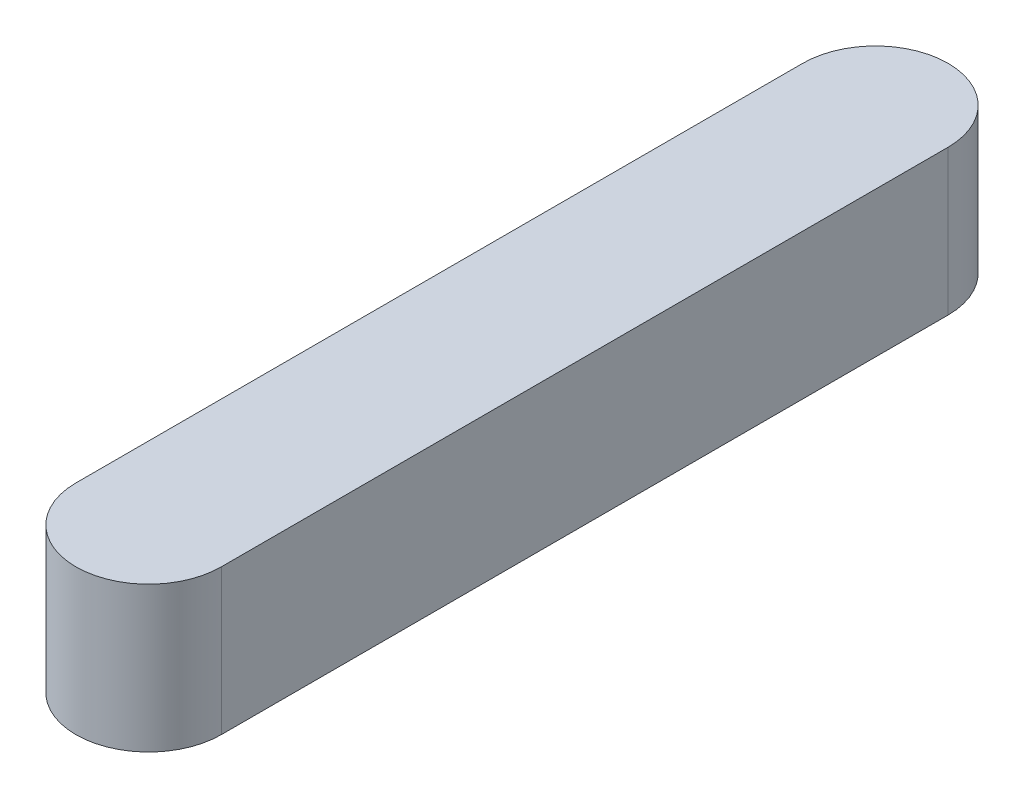
ISO-10303-21;
HEADER;
FILE_DESCRIPTION(('STEP AP214'),'2;1');
FILE_NAME('part.step','',(''),(''),'','','');
FILE_SCHEMA(('AUTOMOTIVE_DESIGN { 1 0 10303 214 1 1 1 1 }'));
ENDSEC;
DATA;
#1=APPLICATION_CONTEXT('core data for automotive mechanical design processes');
#2=APPLICATION_PROTOCOL_DEFINITION('international standard','automotive_design',2000,#1);
#3=PRODUCT_CONTEXT('',#1,'mechanical');
#4=PRODUCT('Part','Part','',(#3));
#5=PRODUCT_RELATED_PRODUCT_CATEGORY('part','',(#4));
#6=PRODUCT_DEFINITION_FORMATION('','',#4);
#7=PRODUCT_DEFINITION_CONTEXT('part definition',#1,'design');
#8=PRODUCT_DEFINITION('design','',#6,#7);
#9=PRODUCT_DEFINITION_SHAPE('','',#8);
#10=(LENGTH_UNIT() NAMED_UNIT(*) SI_UNIT(.MILLI.,.METRE.));
#11=(NAMED_UNIT(*) PLANE_ANGLE_UNIT() SI_UNIT($,.RADIAN.));
#12=(NAMED_UNIT(*) SI_UNIT($,.STERADIAN.) SOLID_ANGLE_UNIT());
#13=UNCERTAINTY_MEASURE_WITH_UNIT(LENGTH_MEASURE(1.E-05),#10,'distance_accuracy_value','');
#14=(GEOMETRIC_REPRESENTATION_CONTEXT(3) GLOBAL_UNCERTAINTY_ASSIGNED_CONTEXT((#13)) GLOBAL_UNIT_ASSIGNED_CONTEXT((#10,
#11,#12)) REPRESENTATION_CONTEXT('',''));
#15=CARTESIAN_POINT('',(0.,0.,0.));
#16=DIRECTION('',(0.,0.,1.));
#17=DIRECTION('',(1.,0.,0.));
#18=AXIS2_PLACEMENT_3D('',#15,#16,#17);
#19=CARTESIAN_POINT('',(0.,10.,0.));
#20=DIRECTION('',(0.,-1.,0.));
#21=DIRECTION('',(0.,0.,-1.));
#22=AXIS2_PLACEMENT_3D('',#19,#20,#21);
#23=CYLINDRICAL_SURFACE('',#22,5.);
#24=CARTESIAN_POINT('',(0.,0.,0.));
#25=DIRECTION('',(0.,1.,0.));
#26=DIRECTION('',(0.,0.,-1.));
#27=AXIS2_PLACEMENT_3D('',#24,#25,#26);
#28=CIRCLE('',#27,5.);
#29=CARTESIAN_POINT('',(5.,0.,0.));
#30=VERTEX_POINT('',#29);
#31=CARTESIAN_POINT('',(-5.,0.,0.));
#32=VERTEX_POINT('',#31);
#33=EDGE_CURVE('E96',#30,#32,#28,.T.);
#34=ORIENTED_EDGE('',*,*,#33,.T.);
#35=DIRECTION('',(0.,-1.,0.));
#36=VECTOR('',#35,1.);
#37=CARTESIAN_POINT('',(-5.,10.,0.));
#38=LINE('',#37,#36);
#39=CARTESIAN_POINT('',(-5.,10.,0.));
#40=VERTEX_POINT('',#39);
#41=EDGE_CURVE('E11',#40,#32,#38,.T.);
#42=ORIENTED_EDGE('',*,*,#41,.F.);
#43=CARTESIAN_POINT('',(0.,10.,0.));
#44=DIRECTION('',(0.,1.,0.));
#45=DIRECTION('',(0.,0.,-1.));
#46=AXIS2_PLACEMENT_3D('',#43,#44,#45);
#47=CIRCLE('',#46,5.);
#48=CARTESIAN_POINT('',(5.,10.,0.));
#49=VERTEX_POINT('',#48);
#50=EDGE_CURVE('E84',#49,#40,#47,.T.);
#51=ORIENTED_EDGE('',*,*,#50,.F.);
#52=DIRECTION('',(0.,-1.,0.));
#53=VECTOR('',#52,1.);
#54=CARTESIAN_POINT('',(5.,10.,0.));
#55=LINE('',#54,#53);
#56=EDGE_CURVE('E92',#49,#30,#55,.T.);
#57=ORIENTED_EDGE('',*,*,#56,.T.);
#58=EDGE_LOOP('',(#34,#42,#51,#57));
#59=FACE_BOUND('',#58,.T.);
#60=ADVANCED_FACE('F33',(#59),#23,.T.);
#61=CARTESIAN_POINT('',(-5.,10.,50.));
#62=DIRECTION('',(1.,0.,0.));
#63=DIRECTION('',(0.,0.,-1.));
#64=AXIS2_PLACEMENT_3D('',#61,#62,#63);
#65=PLANE('',#64);
#66=DIRECTION('',(0.,0.,1.));
#67=VECTOR('',#66,1.);
#68=CARTESIAN_POINT('',(-5.,0.,50.));
#69=LINE('',#68,#67);
#70=CARTESIAN_POINT('',(-5.,0.,50.));
#71=VERTEX_POINT('',#70);
#72=EDGE_CURVE('E88',#32,#71,#69,.T.);
#73=ORIENTED_EDGE('',*,*,#72,.T.);
#74=DIRECTION('',(0.,-1.,0.));
#75=VECTOR('',#74,1.);
#76=CARTESIAN_POINT('',(-5.,10.,50.));
#77=LINE('',#76,#75);
#78=CARTESIAN_POINT('',(-5.,10.,50.));
#79=VERTEX_POINT('',#78);
#80=EDGE_CURVE('E41',#79,#71,#77,.T.);
#81=ORIENTED_EDGE('',*,*,#80,.F.);
#82=DIRECTION('',(0.,0.,1.));
#83=VECTOR('',#82,1.);
#84=CARTESIAN_POINT('',(-5.,10.,50.));
#85=LINE('',#84,#83);
#86=EDGE_CURVE('E79',#40,#79,#85,.T.);
#87=ORIENTED_EDGE('',*,*,#86,.F.);
#88=ORIENTED_EDGE('',*,*,#41,.T.);
#89=EDGE_LOOP('',(#73,#81,#87,#88));
#90=FACE_BOUND('',#89,.T.);
#91=ADVANCED_FACE('F87',(#90),#65,.F.);
#92=CARTESIAN_POINT('',(0.,10.,50.));
#93=DIRECTION('',(0.,-1.,0.));
#94=DIRECTION('',(0.,0.,-1.));
#95=AXIS2_PLACEMENT_3D('',#92,#93,#94);
#96=CYLINDRICAL_SURFACE('',#95,5.);
#97=CARTESIAN_POINT('',(0.,0.,50.));
#98=DIRECTION('',(0.,1.,0.));
#99=DIRECTION('',(0.,0.,-1.));
#100=AXIS2_PLACEMENT_3D('',#97,#98,#99);
#101=CIRCLE('',#100,5.);
#102=CARTESIAN_POINT('',(5.00000000000001,0.,50.));
#103=VERTEX_POINT('',#102);
#104=EDGE_CURVE('E66',#71,#103,#101,.T.);
#105=ORIENTED_EDGE('',*,*,#104,.T.);
#106=DIRECTION('',(0.,-1.,0.));
#107=VECTOR('',#106,1.);
#108=CARTESIAN_POINT('',(5.00000000000001,10.,50.));
#109=LINE('',#108,#107);
#110=CARTESIAN_POINT('',(5.00000000000001,10.,50.));
#111=VERTEX_POINT('',#110);
#112=EDGE_CURVE('E89',#111,#103,#109,.T.);
#113=ORIENTED_EDGE('',*,*,#112,.F.);
#114=CARTESIAN_POINT('',(0.,10.,50.));
#115=DIRECTION('',(0.,1.,0.));
#116=DIRECTION('',(0.,0.,-1.));
#117=AXIS2_PLACEMENT_3D('',#114,#115,#116);
#118=CIRCLE('',#117,5.);
#119=EDGE_CURVE('E82',#79,#111,#118,.T.);
#120=ORIENTED_EDGE('',*,*,#119,.F.);
#121=ORIENTED_EDGE('',*,*,#80,.T.);
#122=EDGE_LOOP('',(#105,#113,#120,#121));
#123=FACE_BOUND('',#122,.T.);
#124=ADVANCED_FACE('F90',(#123),#96,.T.);
#125=CARTESIAN_POINT('',(5.,10.,0.));
#126=DIRECTION('',(-1.,0.,0.));
#127=DIRECTION('',(0.,0.,1.));
#128=AXIS2_PLACEMENT_3D('',#125,#126,#127);
#129=PLANE('',#128);
#130=DIRECTION('',(0.,0.,-1.));
#131=VECTOR('',#130,1.);
#132=CARTESIAN_POINT('',(5.,0.,0.));
#133=LINE('',#132,#131);
#134=EDGE_CURVE('E72',#103,#30,#133,.T.);
#135=ORIENTED_EDGE('',*,*,#134,.T.);
#136=ORIENTED_EDGE('',*,*,#56,.F.);
#137=DIRECTION('',(0.,0.,-1.));
#138=VECTOR('',#137,1.);
#139=CARTESIAN_POINT('',(5.,10.,0.));
#140=LINE('',#139,#138);
#141=EDGE_CURVE('E49',#111,#49,#140,.T.);
#142=ORIENTED_EDGE('',*,*,#141,.F.);
#143=ORIENTED_EDGE('',*,*,#112,.T.);
#144=EDGE_LOOP('',(#135,#136,#142,#143));
#145=FACE_BOUND('',#144,.T.);
#146=ADVANCED_FACE('F103',(#145),#129,.F.);
#147=CARTESIAN_POINT('',(0.,10.,0.));
#148=DIRECTION('',(0.,-1.,0.));
#149=DIRECTION('',(0.,0.,-1.));
#150=AXIS2_PLACEMENT_3D('',#147,#148,#149);
#151=PLANE('',#150);
#152=ORIENTED_EDGE('',*,*,#50,.T.);
#153=ORIENTED_EDGE('',*,*,#86,.T.);
#154=ORIENTED_EDGE('',*,*,#119,.T.);
#155=ORIENTED_EDGE('',*,*,#141,.T.);
#156=EDGE_LOOP('',(#152,#153,#154,#155));
#157=FACE_BOUND('',#156,.T.);
#158=ADVANCED_FACE('F80',(#157),#151,.F.);
#159=CARTESIAN_POINT('',(0.,0.,0.));
#160=DIRECTION('',(0.,-1.,0.));
#161=DIRECTION('',(0.,0.,-1.));
#162=AXIS2_PLACEMENT_3D('',#159,#160,#161);
#163=PLANE('',#162);
#164=ORIENTED_EDGE('',*,*,#33,.F.);
#165=ORIENTED_EDGE('',*,*,#134,.F.);
#166=ORIENTED_EDGE('',*,*,#104,.F.);
#167=ORIENTED_EDGE('',*,*,#72,.F.);
#168=EDGE_LOOP('',(#164,#165,#166,#167));
#169=FACE_BOUND('',#168,.T.);
#170=ADVANCED_FACE('F106',(#169),#163,.T.);
#171=CLOSED_SHELL('',(#60,#91,#124,#146,#158,#170));
#172=MANIFOLD_SOLID_BREP('B2',#171);
#173=ADVANCED_BREP_SHAPE_REPRESENTATION('',(#18,#172),#14);
#174=SHAPE_DEFINITION_REPRESENTATION(#9,#173);
ENDSEC;
END-ISO-10303-21;
